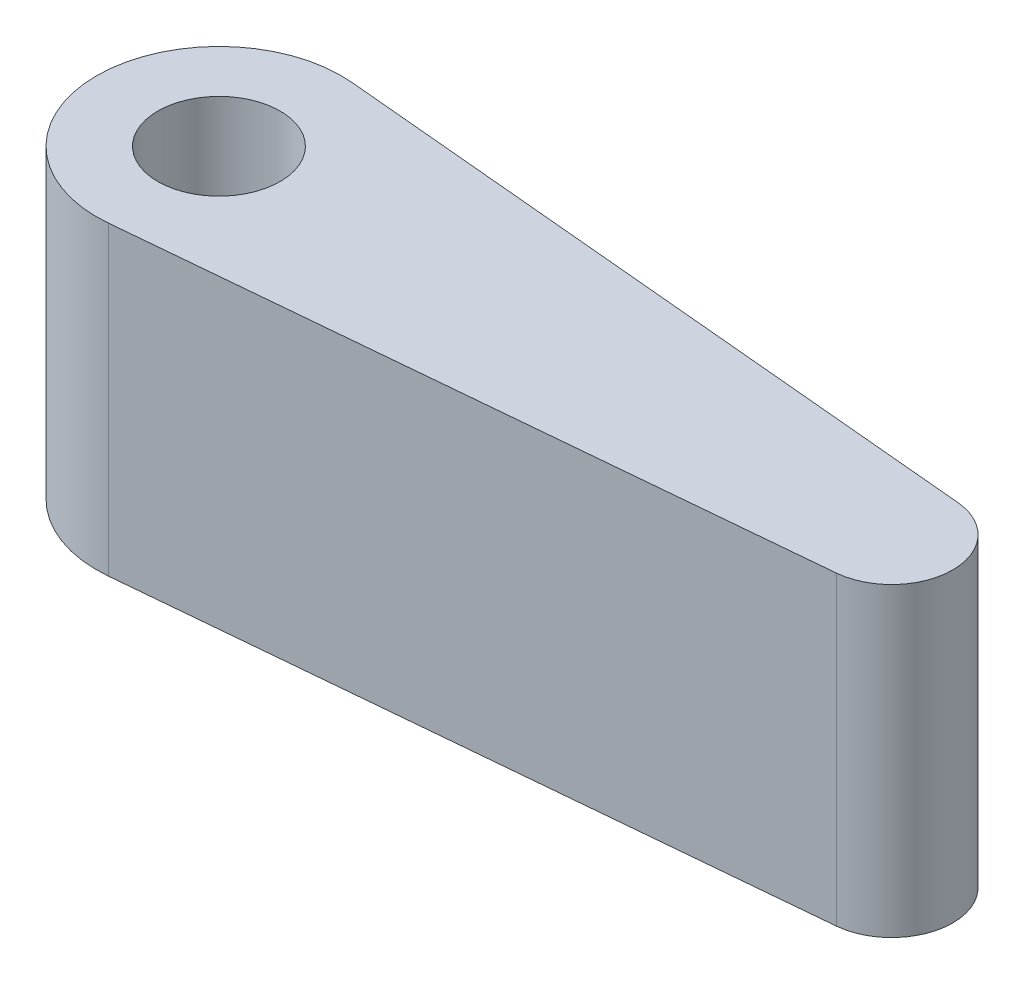
ISO-10303-21;
HEADER;
FILE_DESCRIPTION(('STEP AP214'),'2;1');
FILE_NAME('part.step','',(''),(''),'','','');
FILE_SCHEMA(('AUTOMOTIVE_DESIGN { 1 0 10303 214 1 1 1 1 }'));
ENDSEC;
DATA;
#1=APPLICATION_CONTEXT('core data for automotive mechanical design processes');
#2=APPLICATION_PROTOCOL_DEFINITION('international standard','automotive_design',2000,#1);
#3=PRODUCT_CONTEXT('',#1,'mechanical');
#4=PRODUCT('Part','Part','',(#3));
#5=PRODUCT_RELATED_PRODUCT_CATEGORY('part','',(#4));
#6=PRODUCT_DEFINITION_FORMATION('','',#4);
#7=PRODUCT_DEFINITION_CONTEXT('part definition',#1,'design');
#8=PRODUCT_DEFINITION('design','',#6,#7);
#9=PRODUCT_DEFINITION_SHAPE('','',#8);
#10=(LENGTH_UNIT() NAMED_UNIT(*) SI_UNIT(.MILLI.,.METRE.));
#11=(NAMED_UNIT(*) PLANE_ANGLE_UNIT() SI_UNIT($,.RADIAN.));
#12=(NAMED_UNIT(*) SI_UNIT($,.STERADIAN.) SOLID_ANGLE_UNIT());
#13=UNCERTAINTY_MEASURE_WITH_UNIT(LENGTH_MEASURE(1.E-05),#10,'distance_accuracy_value','');
#14=(GEOMETRIC_REPRESENTATION_CONTEXT(3) GLOBAL_UNCERTAINTY_ASSIGNED_CONTEXT((#13)) GLOBAL_UNIT_ASSIGNED_CONTEXT((#10,
#11,#12)) REPRESENTATION_CONTEXT('',''));
#15=CARTESIAN_POINT('',(0.,0.,0.));
#16=DIRECTION('',(0.,0.,1.));
#17=DIRECTION('',(1.,0.,0.));
#18=AXIS2_PLACEMENT_3D('',#15,#16,#17);
#19=CARTESIAN_POINT('',(30.,25.,0.));
#20=DIRECTION('',(0.,1.,0.));
#21=DIRECTION('',(0.,0.,1.));
#22=AXIS2_PLACEMENT_3D('',#19,#20,#21);
#23=PLANE('',#22);
#24=DIRECTION('',(0.995859195463938,0.,0.0909090909090908));
#25=VECTOR('',#24,1.);
#26=CARTESIAN_POINT('',(-24.0909090909091,25.,-9.95859195463938));
#27=LINE('',#26,#25);
#28=CARTESIAN_POINT('',(-24.0909090909091,25.,-9.95859195463938));
#29=VERTEX_POINT('',#28);
#30=CARTESIAN_POINT('',(30.4545454545455,25.,-4.9792959773197));
#31=VERTEX_POINT('',#30);
#32=EDGE_CURVE('E109',#29,#31,#27,.T.);
#33=ORIENTED_EDGE('',*,*,#32,.F.);
#34=CARTESIAN_POINT('',(-25.,25.,0.));
#35=DIRECTION('',(0.,1.,0.));
#36=DIRECTION('',(0.,0.,1.));
#37=AXIS2_PLACEMENT_3D('',#34,#35,#36);
#38=CIRCLE('',#37,10.);
#39=CARTESIAN_POINT('',(-24.0909090909091,25.,9.95859195463938));
#40=VERTEX_POINT('',#39);
#41=EDGE_CURVE('E97',#29,#40,#38,.T.);
#42=ORIENTED_EDGE('',*,*,#41,.T.);
#43=DIRECTION('',(0.995859195463938,0.,-0.090909090909091));
#44=VECTOR('',#43,1.);
#45=CARTESIAN_POINT('',(-24.0909090909091,25.,9.95859195463938));
#46=LINE('',#45,#44);
#47=CARTESIAN_POINT('',(30.4545454545455,25.,4.97929597731969));
#48=VERTEX_POINT('',#47);
#49=EDGE_CURVE('E94',#40,#48,#46,.T.);
#50=ORIENTED_EDGE('',*,*,#49,.T.);
#51=CARTESIAN_POINT('',(30.,25.,0.));
#52=DIRECTION('',(0.,1.,0.));
#53=DIRECTION('',(0.,0.,1.));
#54=AXIS2_PLACEMENT_3D('',#51,#52,#53);
#55=CIRCLE('',#54,5.);
#56=EDGE_CURVE('E91',#48,#31,#55,.T.);
#57=ORIENTED_EDGE('',*,*,#56,.T.);
#58=EDGE_LOOP('',(#33,#42,#50,#57));
#59=FACE_BOUND('',#58,.T.);
#60=CARTESIAN_POINT('',(-25.,25.,0.));
#61=DIRECTION('',(0.,1.,0.));
#62=DIRECTION('',(0.,0.,1.));
#63=AXIS2_PLACEMENT_3D('',#60,#61,#62);
#64=CIRCLE('',#63,5.);
#65=CARTESIAN_POINT('',(-25.,25.,5.));
#66=VERTEX_POINT('',#65);
#67=EDGE_CURVE('E119',#66,#66,#64,.T.);
#68=ORIENTED_EDGE('',*,*,#67,.F.);
#69=EDGE_LOOP('',(#68));
#70=FACE_BOUND('',#69,.T.);
#71=ADVANCED_FACE('F48',(#59,#70),#23,.T.);
#72=CARTESIAN_POINT('',(30.,0.,0.));
#73=DIRECTION('',(0.,1.,0.));
#74=DIRECTION('',(0.,0.,1.));
#75=AXIS2_PLACEMENT_3D('',#72,#73,#74);
#76=PLANE('',#75);
#77=DIRECTION('',(0.995859195463938,0.,0.0909090909090908));
#78=VECTOR('',#77,1.);
#79=CARTESIAN_POINT('',(-24.0909090909091,0.,-9.95859195463938));
#80=LINE('',#79,#78);
#81=CARTESIAN_POINT('',(-24.0909090909091,0.,-9.95859195463938));
#82=VERTEX_POINT('',#81);
#83=CARTESIAN_POINT('',(30.4545454545455,0.,-4.9792959773197));
#84=VERTEX_POINT('',#83);
#85=EDGE_CURVE('E115',#82,#84,#80,.T.);
#86=ORIENTED_EDGE('',*,*,#85,.T.);
#87=CARTESIAN_POINT('',(30.,0.,0.));
#88=DIRECTION('',(0.,1.,0.));
#89=DIRECTION('',(0.,0.,1.));
#90=AXIS2_PLACEMENT_3D('',#87,#88,#89);
#91=CIRCLE('',#90,5.);
#92=CARTESIAN_POINT('',(30.4545454545455,0.,4.97929597731969));
#93=VERTEX_POINT('',#92);
#94=EDGE_CURVE('E118',#93,#84,#91,.T.);
#95=ORIENTED_EDGE('',*,*,#94,.F.);
#96=DIRECTION('',(0.995859195463938,0.,-0.090909090909091));
#97=VECTOR('',#96,1.);
#98=CARTESIAN_POINT('',(-24.0909090909091,0.,9.95859195463938));
#99=LINE('',#98,#97);
#100=CARTESIAN_POINT('',(-24.0909090909091,0.,9.95859195463938));
#101=VERTEX_POINT('',#100);
#102=EDGE_CURVE('E104',#101,#93,#99,.T.);
#103=ORIENTED_EDGE('',*,*,#102,.F.);
#104=CARTESIAN_POINT('',(-25.,0.,0.));
#105=DIRECTION('',(0.,1.,0.));
#106=DIRECTION('',(0.,0.,1.));
#107=AXIS2_PLACEMENT_3D('',#104,#105,#106);
#108=CIRCLE('',#107,10.);
#109=EDGE_CURVE('E82',#82,#101,#108,.T.);
#110=ORIENTED_EDGE('',*,*,#109,.F.);
#111=EDGE_LOOP('',(#86,#95,#103,#110));
#112=FACE_BOUND('',#111,.T.);
#113=CARTESIAN_POINT('',(-25.,0.,0.));
#114=DIRECTION('',(0.,1.,0.));
#115=DIRECTION('',(0.,0.,1.));
#116=AXIS2_PLACEMENT_3D('',#113,#114,#115);
#117=CIRCLE('',#116,5.);
#118=CARTESIAN_POINT('',(-25.,0.,5.));
#119=VERTEX_POINT('',#118);
#120=EDGE_CURVE('E154',#119,#119,#117,.T.);
#121=ORIENTED_EDGE('',*,*,#120,.T.);
#122=EDGE_LOOP('',(#121));
#123=FACE_BOUND('',#122,.T.);
#124=ADVANCED_FACE('F124',(#112,#123),#76,.F.);
#125=CARTESIAN_POINT('',(-24.0909090909091,25.,-9.95859195463938));
#126=DIRECTION('',(0.0909090909090908,0.,-0.995859195463938));
#127=DIRECTION('',(-0.995859195463938,0.,-0.0909090909090908));
#128=AXIS2_PLACEMENT_3D('',#125,#126,#127);
#129=PLANE('',#128);
#130=ORIENTED_EDGE('',*,*,#85,.F.);
#131=DIRECTION('',(0.,-1.,0.));
#132=VECTOR('',#131,1.);
#133=CARTESIAN_POINT('',(-24.0909090909091,25.,-9.95859195463938));
#134=LINE('',#133,#132);
#135=EDGE_CURVE('E12',#29,#82,#134,.T.);
#136=ORIENTED_EDGE('',*,*,#135,.F.);
#137=ORIENTED_EDGE('',*,*,#32,.T.);
#138=DIRECTION('',(0.,-1.,0.));
#139=VECTOR('',#138,1.);
#140=CARTESIAN_POINT('',(30.4545454545455,25.,-4.9792959773197));
#141=LINE('',#140,#139);
#142=EDGE_CURVE('E52',#31,#84,#141,.T.);
#143=ORIENTED_EDGE('',*,*,#142,.T.);
#144=EDGE_LOOP('',(#130,#136,#137,#143));
#145=FACE_BOUND('',#144,.T.);
#146=ADVANCED_FACE('F50',(#145),#129,.T.);
#147=CARTESIAN_POINT('',(-25.,25.,0.));
#148=DIRECTION('',(0.,-1.,0.));
#149=DIRECTION('',(0.,0.,-1.));
#150=AXIS2_PLACEMENT_3D('',#147,#148,#149);
#151=CYLINDRICAL_SURFACE('',#150,10.);
#152=ORIENTED_EDGE('',*,*,#109,.T.);
#153=DIRECTION('',(0.,-1.,0.));
#154=VECTOR('',#153,1.);
#155=CARTESIAN_POINT('',(-24.0909090909091,25.,9.95859195463938));
#156=LINE('',#155,#154);
#157=EDGE_CURVE('E58',#40,#101,#156,.T.);
#158=ORIENTED_EDGE('',*,*,#157,.F.);
#159=ORIENTED_EDGE('',*,*,#41,.F.);
#160=ORIENTED_EDGE('',*,*,#135,.T.);
#161=EDGE_LOOP('',(#152,#158,#159,#160));
#162=FACE_BOUND('',#161,.T.);
#163=ADVANCED_FACE('F127',(#162),#151,.T.);
#164=CARTESIAN_POINT('',(-24.0909090909091,25.,9.95859195463938));
#165=DIRECTION('',(-0.090909090909091,0.,-0.995859195463938));
#166=DIRECTION('',(-0.995859195463938,0.,0.090909090909091));
#167=AXIS2_PLACEMENT_3D('',#164,#165,#166);
#168=PLANE('',#167);
#169=ORIENTED_EDGE('',*,*,#102,.T.);
#170=DIRECTION('',(0.,-1.,0.));
#171=VECTOR('',#170,1.);
#172=CARTESIAN_POINT('',(30.4545454545455,25.,4.97929597731969));
#173=LINE('',#172,#171);
#174=EDGE_CURVE('E101',#48,#93,#173,.T.);
#175=ORIENTED_EDGE('',*,*,#174,.F.);
#176=ORIENTED_EDGE('',*,*,#49,.F.);
#177=ORIENTED_EDGE('',*,*,#157,.T.);
#178=EDGE_LOOP('',(#169,#175,#176,#177));
#179=FACE_BOUND('',#178,.T.);
#180=ADVANCED_FACE('F102',(#179),#168,.F.);
#181=CARTESIAN_POINT('',(30.,25.,0.));
#182=DIRECTION('',(0.,-1.,0.));
#183=DIRECTION('',(0.,0.,-1.));
#184=AXIS2_PLACEMENT_3D('',#181,#182,#183);
#185=CYLINDRICAL_SURFACE('',#184,5.);
#186=ORIENTED_EDGE('',*,*,#94,.T.);
#187=ORIENTED_EDGE('',*,*,#142,.F.);
#188=ORIENTED_EDGE('',*,*,#56,.F.);
#189=ORIENTED_EDGE('',*,*,#174,.T.);
#190=EDGE_LOOP('',(#186,#187,#188,#189));
#191=FACE_BOUND('',#190,.T.);
#192=ADVANCED_FACE('F108',(#191),#185,.T.);
#193=CARTESIAN_POINT('',(-25.,25.,0.));
#194=DIRECTION('',(0.,-1.,0.));
#195=DIRECTION('',(0.,0.,-1.));
#196=AXIS2_PLACEMENT_3D('',#193,#194,#195);
#197=CYLINDRICAL_SURFACE('',#196,5.);
#198=ORIENTED_EDGE('',*,*,#67,.T.);
#199=EDGE_LOOP('',(#198));
#200=FACE_BOUND('',#199,.T.);
#201=ORIENTED_EDGE('',*,*,#120,.F.);
#202=EDGE_LOOP('',(#201));
#203=FACE_BOUND('',#202,.T.);
#204=ADVANCED_FACE('F139',(#200,#203),#197,.F.);
#205=CLOSED_SHELL('',(#71,#124,#146,#163,#180,#192,#204));
#206=MANIFOLD_SOLID_BREP('B2',#205);
#207=ADVANCED_BREP_SHAPE_REPRESENTATION('',(#18,#206),#14);
#208=SHAPE_DEFINITION_REPRESENTATION(#9,#207);
ENDSEC;
END-ISO-10303-21;
